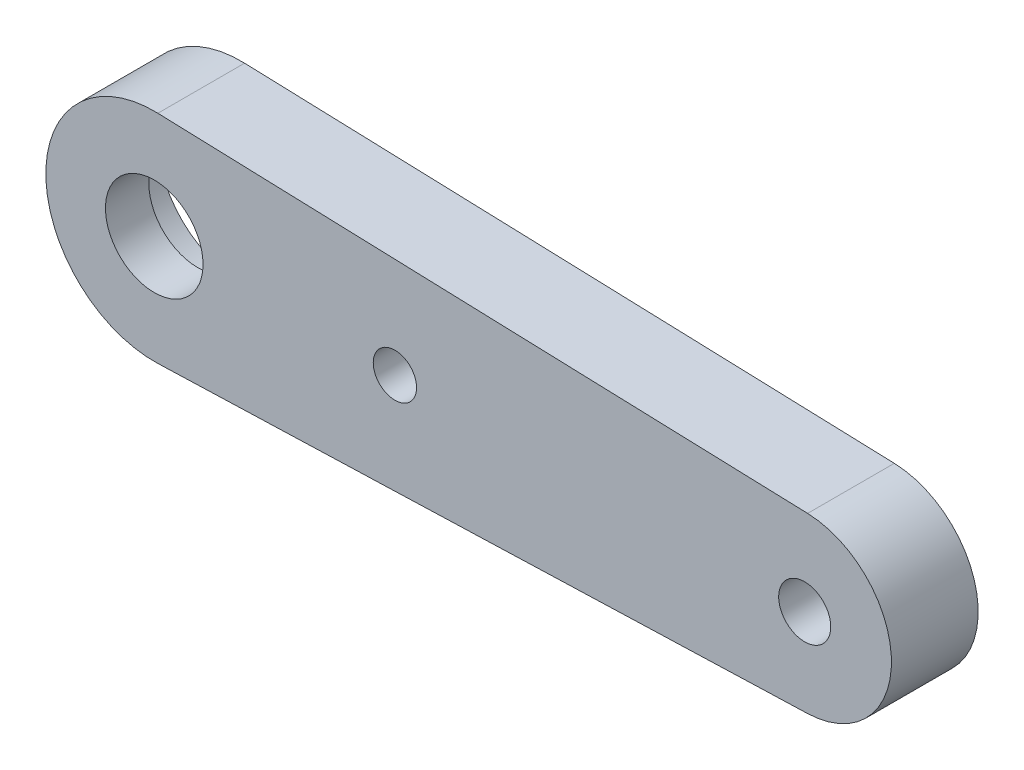
ISO-10303-21;
HEADER;
FILE_DESCRIPTION(('STEP AP214'),'2;1');
FILE_NAME('part.step','',(''),(''),'','','');
FILE_SCHEMA(('AUTOMOTIVE_DESIGN { 1 0 10303 214 1 1 1 1 }'));
ENDSEC;
DATA;
#1=APPLICATION_CONTEXT('core data for automotive mechanical design processes');
#2=APPLICATION_PROTOCOL_DEFINITION('international standard','automotive_design',2000,#1);
#3=PRODUCT_CONTEXT('',#1,'mechanical');
#4=PRODUCT('Part','Part','',(#3));
#5=PRODUCT_RELATED_PRODUCT_CATEGORY('part','',(#4));
#6=PRODUCT_DEFINITION_FORMATION('','',#4);
#7=PRODUCT_DEFINITION_CONTEXT('part definition',#1,'design');
#8=PRODUCT_DEFINITION('design','',#6,#7);
#9=PRODUCT_DEFINITION_SHAPE('','',#8);
#10=(LENGTH_UNIT() NAMED_UNIT(*) SI_UNIT(.MILLI.,.METRE.));
#11=(NAMED_UNIT(*) PLANE_ANGLE_UNIT() SI_UNIT($,.RADIAN.));
#12=(NAMED_UNIT(*) SI_UNIT($,.STERADIAN.) SOLID_ANGLE_UNIT());
#13=UNCERTAINTY_MEASURE_WITH_UNIT(LENGTH_MEASURE(1.E-05),#10,'distance_accuracy_value','');
#14=(GEOMETRIC_REPRESENTATION_CONTEXT(3) GLOBAL_UNCERTAINTY_ASSIGNED_CONTEXT((#13)) GLOBAL_UNIT_ASSIGNED_CONTEXT((#10,
#11,#12)) REPRESENTATION_CONTEXT('',''));
#15=CARTESIAN_POINT('',(0.,0.,0.));
#16=DIRECTION('',(0.,0.,1.));
#17=DIRECTION('',(1.,0.,0.));
#18=AXIS2_PLACEMENT_3D('',#15,#16,#17);
#19=CARTESIAN_POINT('',(0.166666666666667,-4.99722145018832,4.));
#20=DIRECTION('',(-0.0333333333333334,0.999444290037663,0.));
#21=DIRECTION('',(-0.999444290037663,-0.0333333333333334,0.));
#22=AXIS2_PLACEMENT_3D('',#19,#20,#21);
#23=PLANE('',#22);
#24=DIRECTION('',(0.999444290037663,0.0333333333333334,0.));
#25=VECTOR('',#24,1.);
#26=CARTESIAN_POINT('',(0.166666666666667,-4.99722145018832,0.));
#27=LINE('',#26,#25);
#28=CARTESIAN_POINT('',(0.166666666666667,-4.99722145018832,0.));
#29=VERTEX_POINT('',#28);
#30=CARTESIAN_POINT('',(30.1333333333333,-3.99777716015066,0.));
#31=VERTEX_POINT('',#30);
#32=EDGE_CURVE('E184',#29,#31,#27,.T.);
#33=ORIENTED_EDGE('',*,*,#32,.T.);
#34=DIRECTION('',(0.,0.,-1.));
#35=VECTOR('',#34,1.);
#36=CARTESIAN_POINT('',(30.1333333333333,-3.99777716015066,4.));
#37=LINE('',#36,#35);
#38=CARTESIAN_POINT('',(30.1333333333333,-3.99777716015066,4.));
#39=VERTEX_POINT('',#38);
#40=EDGE_CURVE('E11',#39,#31,#37,.T.);
#41=ORIENTED_EDGE('',*,*,#40,.F.);
#42=DIRECTION('',(0.999444290037663,0.0333333333333334,0.));
#43=VECTOR('',#42,1.);
#44=CARTESIAN_POINT('',(0.166666666666667,-4.99722145018832,4.));
#45=LINE('',#44,#43);
#46=CARTESIAN_POINT('',(0.166666666666667,-4.99722145018832,4.));
#47=VERTEX_POINT('',#46);
#48=EDGE_CURVE('E185',#47,#39,#45,.T.);
#49=ORIENTED_EDGE('',*,*,#48,.F.);
#50=DIRECTION('',(0.,0.,-1.));
#51=VECTOR('',#50,1.);
#52=CARTESIAN_POINT('',(0.166666666666667,-4.99722145018832,4.));
#53=LINE('',#52,#51);
#54=EDGE_CURVE('E196',#47,#29,#53,.T.);
#55=ORIENTED_EDGE('',*,*,#54,.T.);
#56=EDGE_LOOP('',(#33,#41,#49,#55));
#57=FACE_BOUND('',#56,.T.);
#58=ADVANCED_FACE('F39',(#57),#23,.F.);
#59=CARTESIAN_POINT('',(30.,0.,4.));
#60=DIRECTION('',(0.,0.,-1.));
#61=DIRECTION('',(-1.,0.,0.));
#62=AXIS2_PLACEMENT_3D('',#59,#60,#61);
#63=CYLINDRICAL_SURFACE('',#62,4.00000000000001);
#64=CARTESIAN_POINT('',(30.,0.,0.));
#65=DIRECTION('',(0.,0.,1.));
#66=DIRECTION('',(1.,0.,0.));
#67=AXIS2_PLACEMENT_3D('',#64,#65,#66);
#68=CIRCLE('',#67,4.00000000000001);
#69=CARTESIAN_POINT('',(30.1333333333333,3.99777716015066,0.));
#70=VERTEX_POINT('',#69);
#71=EDGE_CURVE('E199',#31,#70,#68,.T.);
#72=ORIENTED_EDGE('',*,*,#71,.T.);
#73=DIRECTION('',(0.,0.,-1.));
#74=VECTOR('',#73,1.);
#75=CARTESIAN_POINT('',(30.1333333333333,3.99777716015066,4.));
#76=LINE('',#75,#74);
#77=CARTESIAN_POINT('',(30.1333333333333,3.99777716015066,4.));
#78=VERTEX_POINT('',#77);
#79=EDGE_CURVE('E47',#78,#70,#76,.T.);
#80=ORIENTED_EDGE('',*,*,#79,.F.);
#81=CARTESIAN_POINT('',(30.,0.,4.));
#82=DIRECTION('',(0.,0.,1.));
#83=DIRECTION('',(1.,0.,0.));
#84=AXIS2_PLACEMENT_3D('',#81,#82,#83);
#85=CIRCLE('',#84,4.00000000000001);
#86=EDGE_CURVE('E91',#39,#78,#85,.T.);
#87=ORIENTED_EDGE('',*,*,#86,.F.);
#88=ORIENTED_EDGE('',*,*,#40,.T.);
#89=EDGE_LOOP('',(#72,#80,#87,#88));
#90=FACE_BOUND('',#89,.T.);
#91=ADVANCED_FACE('F214',(#90),#63,.T.);
#92=CARTESIAN_POINT('',(0.166666666666667,4.99722145018832,4.));
#93=DIRECTION('',(0.0333333333333333,0.999444290037663,0.));
#94=DIRECTION('',(-0.999444290037663,0.0333333333333333,0.));
#95=AXIS2_PLACEMENT_3D('',#92,#93,#94);
#96=PLANE('',#95);
#97=DIRECTION('',(0.999444290037663,-0.0333333333333333,0.));
#98=VECTOR('',#97,1.);
#99=CARTESIAN_POINT('',(0.166666666666667,4.99722145018832,0.));
#100=LINE('',#99,#98);
#101=CARTESIAN_POINT('',(0.166666666666665,4.99722145018832,0.));
#102=VERTEX_POINT('',#101);
#103=EDGE_CURVE('E202',#102,#70,#100,.T.);
#104=ORIENTED_EDGE('',*,*,#103,.F.);
#105=DIRECTION('',(0.,0.,-1.));
#106=VECTOR('',#105,1.);
#107=CARTESIAN_POINT('',(0.166666666666665,4.99722145018832,4.));
#108=LINE('',#107,#106);
#109=CARTESIAN_POINT('',(0.166666666666665,4.99722145018832,4.));
#110=VERTEX_POINT('',#109);
#111=EDGE_CURVE('E209',#110,#102,#108,.T.);
#112=ORIENTED_EDGE('',*,*,#111,.F.);
#113=DIRECTION('',(0.999444290037663,-0.0333333333333333,0.));
#114=VECTOR('',#113,1.);
#115=CARTESIAN_POINT('',(0.166666666666667,4.99722145018832,4.));
#116=LINE('',#115,#114);
#117=EDGE_CURVE('E189',#110,#78,#116,.T.);
#118=ORIENTED_EDGE('',*,*,#117,.T.);
#119=ORIENTED_EDGE('',*,*,#79,.T.);
#120=EDGE_LOOP('',(#104,#112,#118,#119));
#121=FACE_BOUND('',#120,.T.);
#122=ADVANCED_FACE('F213',(#121),#96,.T.);
#123=CARTESIAN_POINT('',(0.,0.,4.));
#124=DIRECTION('',(0.,0.,-1.));
#125=DIRECTION('',(-1.,0.,0.));
#126=AXIS2_PLACEMENT_3D('',#123,#124,#125);
#127=CYLINDRICAL_SURFACE('',#126,5.);
#128=CARTESIAN_POINT('',(0.,0.,0.));
#129=DIRECTION('',(0.,0.,1.));
#130=DIRECTION('',(1.,0.,0.));
#131=AXIS2_PLACEMENT_3D('',#128,#129,#130);
#132=CIRCLE('',#131,5.);
#133=EDGE_CURVE('E84',#102,#29,#132,.T.);
#134=ORIENTED_EDGE('',*,*,#133,.T.);
#135=ORIENTED_EDGE('',*,*,#54,.F.);
#136=CARTESIAN_POINT('',(0.,0.,4.));
#137=DIRECTION('',(0.,0.,1.));
#138=DIRECTION('',(1.,0.,0.));
#139=AXIS2_PLACEMENT_3D('',#136,#137,#138);
#140=CIRCLE('',#139,5.);
#141=EDGE_CURVE('E63',#110,#47,#140,.T.);
#142=ORIENTED_EDGE('',*,*,#141,.F.);
#143=ORIENTED_EDGE('',*,*,#111,.T.);
#144=EDGE_LOOP('',(#134,#135,#142,#143));
#145=FACE_BOUND('',#144,.T.);
#146=ADVANCED_FACE('F222',(#145),#127,.T.);
#147=CARTESIAN_POINT('',(30.,0.,4.));
#148=DIRECTION('',(0.,0.,-1.));
#149=DIRECTION('',(-1.,0.,0.));
#150=AXIS2_PLACEMENT_3D('',#147,#148,#149);
#151=CYLINDRICAL_SURFACE('',#150,1.2);
#152=CARTESIAN_POINT('',(30.,0.,4.));
#153=DIRECTION('',(0.,0.,1.));
#154=DIRECTION('',(1.,0.,0.));
#155=AXIS2_PLACEMENT_3D('',#152,#153,#154);
#156=CIRCLE('',#155,1.2);
#157=CARTESIAN_POINT('',(31.2,0.,4.));
#158=VERTEX_POINT('',#157);
#159=EDGE_CURVE('E193',#158,#158,#156,.T.);
#160=ORIENTED_EDGE('',*,*,#159,.T.);
#161=EDGE_LOOP('',(#160));
#162=FACE_BOUND('',#161,.T.);
#163=CARTESIAN_POINT('',(30.,0.,0.));
#164=DIRECTION('',(0.,0.,1.));
#165=DIRECTION('',(1.,0.,0.));
#166=AXIS2_PLACEMENT_3D('',#163,#164,#165);
#167=CIRCLE('',#166,1.2);
#168=CARTESIAN_POINT('',(31.2,0.,0.));
#169=VERTEX_POINT('',#168);
#170=EDGE_CURVE('E187',#169,#169,#167,.T.);
#171=ORIENTED_EDGE('',*,*,#170,.F.);
#172=EDGE_LOOP('',(#171));
#173=FACE_BOUND('',#172,.T.);
#174=ADVANCED_FACE('F226',(#162,#173),#151,.F.);
#175=CARTESIAN_POINT('',(0.,0.,4.));
#176=DIRECTION('',(0.,0.,1.));
#177=DIRECTION('',(1.,0.,0.));
#178=AXIS2_PLACEMENT_3D('',#175,#176,#177);
#179=PLANE('',#178);
#180=CARTESIAN_POINT('',(-3.0739299994309E-12,1.05644659686988E-12,4.));
#181=DIRECTION('',(0.,0.,1.));
#182=DIRECTION('',(1.,0.,0.));
#183=AXIS2_PLACEMENT_3D('',#180,#181,#182);
#184=CIRCLE('',#183,2.25000000000266);
#185=CARTESIAN_POINT('',(2.24999999999959,1.05644659686988E-12,4.));
#186=VERTEX_POINT('',#185);
#187=EDGE_CURVE('E450',#186,#186,#184,.T.);
#188=ORIENTED_EDGE('',*,*,#187,.F.);
#189=EDGE_LOOP('',(#188));
#190=FACE_BOUND('',#189,.T.);
#191=CARTESIAN_POINT('',(11.1,0.,4.));
#192=DIRECTION('',(0.,0.,1.));
#193=DIRECTION('',(1.,0.,0.));
#194=AXIS2_PLACEMENT_3D('',#191,#192,#193);
#195=CIRCLE('',#194,1.);
#196=CARTESIAN_POINT('',(12.1,0.,4.));
#197=VERTEX_POINT('',#196);
#198=EDGE_CURVE('E156',#197,#197,#195,.T.);
#199=ORIENTED_EDGE('',*,*,#198,.F.);
#200=EDGE_LOOP('',(#199));
#201=FACE_BOUND('',#200,.T.);
#202=ORIENTED_EDGE('',*,*,#48,.T.);
#203=ORIENTED_EDGE('',*,*,#86,.T.);
#204=ORIENTED_EDGE('',*,*,#117,.F.);
#205=ORIENTED_EDGE('',*,*,#141,.T.);
#206=EDGE_LOOP('',(#202,#203,#204,#205));
#207=FACE_BOUND('',#206,.T.);
#208=ORIENTED_EDGE('',*,*,#159,.F.);
#209=EDGE_LOOP('',(#208));
#210=FACE_BOUND('',#209,.T.);
#211=ADVANCED_FACE('F223',(#190,#201,#207,#210),#179,.T.);
#212=CARTESIAN_POINT('',(0.,0.,0.));
#213=DIRECTION('',(0.,0.,1.));
#214=DIRECTION('',(1.,0.,0.));
#215=AXIS2_PLACEMENT_3D('',#212,#213,#214);
#216=PLANE('',#215);
#217=CARTESIAN_POINT('',(0.,0.,0.));
#218=DIRECTION('',(0.,0.,1.));
#219=DIRECTION('',(1.,0.,0.));
#220=AXIS2_PLACEMENT_3D('',#217,#218,#219);
#221=CIRCLE('',#220,3.85);
#222=CARTESIAN_POINT('',(0.363207547169811,-3.83282927844157,0.));
#223=VERTEX_POINT('',#222);
#224=CARTESIAN_POINT('',(0.363207547169811,3.83282927844157,0.));
#225=VERTEX_POINT('',#224);
#226=EDGE_CURVE('E178',#223,#225,#221,.F.);
#227=ORIENTED_EDGE('',*,*,#226,.F.);
#228=DIRECTION('',(-0.995540072322485,-0.0943396226415095,0.));
#229=VECTOR('',#228,1.);
#230=CARTESIAN_POINT('',(0.363207547169812,-3.83282927844157,0.));
#231=LINE('',#230,#229);
#232=CARTESIAN_POINT('',(16.1216981132075,-2.33951916995784,0.));
#233=VERTEX_POINT('',#232);
#234=EDGE_CURVE('E134',#233,#223,#231,.T.);
#235=ORIENTED_EDGE('',*,*,#234,.F.);
#236=CARTESIAN_POINT('',(15.9,0.,0.));
#237=DIRECTION('',(0.,0.,1.));
#238=DIRECTION('',(1.,0.,0.));
#239=AXIS2_PLACEMENT_3D('',#236,#237,#238);
#240=CIRCLE('',#239,2.35);
#241=CARTESIAN_POINT('',(16.1216981132075,2.33951916995784,0.));
#242=VERTEX_POINT('',#241);
#243=EDGE_CURVE('E180',#242,#233,#240,.F.);
#244=ORIENTED_EDGE('',*,*,#243,.F.);
#245=DIRECTION('',(-0.995540072322485,0.0943396226415095,0.));
#246=VECTOR('',#245,1.);
#247=CARTESIAN_POINT('',(0.363207547169812,3.83282927844157,0.));
#248=LINE('',#247,#246);
#249=EDGE_CURVE('E137',#242,#225,#248,.T.);
#250=ORIENTED_EDGE('',*,*,#249,.T.);
#251=EDGE_LOOP('',(#227,#235,#244,#250));
#252=FACE_BOUND('',#251,.T.);
#253=ORIENTED_EDGE('',*,*,#32,.F.);
#254=ORIENTED_EDGE('',*,*,#133,.F.);
#255=ORIENTED_EDGE('',*,*,#103,.T.);
#256=ORIENTED_EDGE('',*,*,#71,.F.);
#257=EDGE_LOOP('',(#253,#254,#255,#256));
#258=FACE_BOUND('',#257,.T.);
#259=ORIENTED_EDGE('',*,*,#170,.T.);
#260=EDGE_LOOP('',(#259));
#261=FACE_BOUND('',#260,.T.);
#262=ADVANCED_FACE('F218',(#252,#258,#261),#216,.F.);
#263=CARTESIAN_POINT('',(0.363207547169812,-3.83282927844157,-23.4029912618024));
#264=DIRECTION('',(0.0943396226415095,-0.995540072322485,0.));
#265=DIRECTION('',(0.995540072322485,0.0943396226415095,0.));
#266=AXIS2_PLACEMENT_3D('',#263,#264,#265);
#267=PLANE('',#266);
#268=ORIENTED_EDGE('',*,*,#234,.T.);
#269=DIRECTION('',(0.,0.,1.));
#270=VECTOR('',#269,1.);
#271=CARTESIAN_POINT('',(0.363207547169811,-3.83282927844157,-23.4029912618024));
#272=LINE('',#271,#270);
#273=CARTESIAN_POINT('',(0.363207547169812,-3.83282927844157,2.));
#274=VERTEX_POINT('',#273);
#275=EDGE_CURVE('E126',#223,#274,#272,.T.);
#276=ORIENTED_EDGE('',*,*,#275,.T.);
#277=DIRECTION('',(-0.995540072322485,-0.0943396226415095,0.));
#278=VECTOR('',#277,1.);
#279=CARTESIAN_POINT('',(0.363207547169812,-3.83282927844157,2.));
#280=LINE('',#279,#278);
#281=CARTESIAN_POINT('',(6.,-3.29867411212271,2.));
#282=VERTEX_POINT('',#281);
#283=EDGE_CURVE('E130',#282,#274,#280,.T.);
#284=ORIENTED_EDGE('',*,*,#283,.F.);
#285=DIRECTION('',(0.,0.,-1.));
#286=VECTOR('',#285,1.);
#287=CARTESIAN_POINT('',(6.,-3.29867411212271,2.));
#288=LINE('',#287,#286);
#289=CARTESIAN_POINT('',(6.,-3.29867411212271,1.5));
#290=VERTEX_POINT('',#289);
#291=EDGE_CURVE('E164',#282,#290,#288,.T.);
#292=ORIENTED_EDGE('',*,*,#291,.T.);
#293=DIRECTION('',(0.995540072322485,0.0943396226415095,0.));
#294=VECTOR('',#293,1.);
#295=CARTESIAN_POINT('',(0.363207547169812,-3.83282927844157,1.5));
#296=LINE('',#295,#294);
#297=CARTESIAN_POINT('',(16.1216981132075,-2.33951916995784,1.5));
#298=VERTEX_POINT('',#297);
#299=EDGE_CURVE('E171',#290,#298,#296,.T.);
#300=ORIENTED_EDGE('',*,*,#299,.T.);
#301=DIRECTION('',(0.,0.,1.));
#302=VECTOR('',#301,1.);
#303=CARTESIAN_POINT('',(16.1216981132075,-2.33951916995784,-23.4029912618024));
#304=LINE('',#303,#302);
#305=EDGE_CURVE('E138',#233,#298,#304,.T.);
#306=ORIENTED_EDGE('',*,*,#305,.F.);
#307=EDGE_LOOP('',(#268,#276,#284,#292,#300,#306));
#308=FACE_BOUND('',#307,.T.);
#309=ADVANCED_FACE('F128',(#308),#267,.F.);
#310=CARTESIAN_POINT('',(0.,0.,-23.4029912618024));
#311=DIRECTION('',(0.,0.,1.));
#312=DIRECTION('',(1.,0.,0.));
#313=AXIS2_PLACEMENT_3D('',#310,#311,#312);
#314=CYLINDRICAL_SURFACE('',#313,3.85);
#315=ORIENTED_EDGE('',*,*,#226,.T.);
#316=DIRECTION('',(0.,0.,1.));
#317=VECTOR('',#316,1.);
#318=CARTESIAN_POINT('',(0.363207547169811,3.83282927844157,-23.4029912618024));
#319=LINE('',#318,#317);
#320=CARTESIAN_POINT('',(0.363207547169811,3.83282927844157,2.));
#321=VERTEX_POINT('',#320);
#322=EDGE_CURVE('E144',#225,#321,#319,.T.);
#323=ORIENTED_EDGE('',*,*,#322,.T.);
#324=CARTESIAN_POINT('',(0.,0.,2.));
#325=DIRECTION('',(0.,0.,-1.));
#326=DIRECTION('',(-1.,0.,0.));
#327=AXIS2_PLACEMENT_3D('',#324,#325,#326);
#328=CIRCLE('',#327,3.85);
#329=EDGE_CURVE('E141',#274,#321,#328,.T.);
#330=ORIENTED_EDGE('',*,*,#329,.F.);
#331=ORIENTED_EDGE('',*,*,#275,.F.);
#332=EDGE_LOOP('',(#315,#323,#330,#331));
#333=FACE_BOUND('',#332,.T.);
#334=ADVANCED_FACE('F142',(#333),#314,.F.);
#335=CARTESIAN_POINT('',(0.363207547169812,3.83282927844157,-23.4029912618024));
#336=DIRECTION('',(-0.0943396226415095,-0.995540072322485,0.));
#337=DIRECTION('',(0.995540072322485,-0.0943396226415095,0.));
#338=AXIS2_PLACEMENT_3D('',#335,#336,#337);
#339=PLANE('',#338);
#340=DIRECTION('',(0.,0.,1.));
#341=VECTOR('',#340,1.);
#342=CARTESIAN_POINT('',(16.1216981132075,2.33951916995784,-23.4029912618024));
#343=LINE('',#342,#341);
#344=CARTESIAN_POINT('',(16.1216981132075,2.33951916995784,1.5));
#345=VERTEX_POINT('',#344);
#346=EDGE_CURVE('E54',#242,#345,#343,.T.);
#347=ORIENTED_EDGE('',*,*,#346,.T.);
#348=DIRECTION('',(0.995540072322485,-0.0943396226415095,0.));
#349=VECTOR('',#348,1.);
#350=CARTESIAN_POINT('',(0.363207547169812,3.83282927844157,1.5));
#351=LINE('',#350,#349);
#352=CARTESIAN_POINT('',(6.,3.2986741121227,1.5));
#353=VERTEX_POINT('',#352);
#354=EDGE_CURVE('E167',#353,#345,#351,.T.);
#355=ORIENTED_EDGE('',*,*,#354,.F.);
#356=DIRECTION('',(0.,0.,-1.));
#357=VECTOR('',#356,1.);
#358=CARTESIAN_POINT('',(6.,3.2986741121227,2.));
#359=LINE('',#358,#357);
#360=CARTESIAN_POINT('',(6.,3.2986741121227,2.));
#361=VERTEX_POINT('',#360);
#362=EDGE_CURVE('E162',#361,#353,#359,.T.);
#363=ORIENTED_EDGE('',*,*,#362,.F.);
#364=DIRECTION('',(0.995540072322485,-0.0943396226415095,0.));
#365=VECTOR('',#364,1.);
#366=CARTESIAN_POINT('',(0.363207547169812,3.83282927844157,2.));
#367=LINE('',#366,#365);
#368=EDGE_CURVE('E148',#321,#361,#367,.T.);
#369=ORIENTED_EDGE('',*,*,#368,.F.);
#370=ORIENTED_EDGE('',*,*,#322,.F.);
#371=ORIENTED_EDGE('',*,*,#249,.F.);
#372=EDGE_LOOP('',(#347,#355,#363,#369,#370,#371));
#373=FACE_BOUND('',#372,.T.);
#374=ADVANCED_FACE('F314',(#373),#339,.T.);
#375=CARTESIAN_POINT('',(15.9,0.,-23.4029912618024));
#376=DIRECTION('',(0.,0.,1.));
#377=DIRECTION('',(1.,0.,0.));
#378=AXIS2_PLACEMENT_3D('',#375,#376,#377);
#379=CYLINDRICAL_SURFACE('',#378,2.35);
#380=ORIENTED_EDGE('',*,*,#243,.T.);
#381=ORIENTED_EDGE('',*,*,#305,.T.);
#382=CARTESIAN_POINT('',(15.9,0.,1.5));
#383=DIRECTION('',(0.,0.,1.));
#384=DIRECTION('',(1.,0.,0.));
#385=AXIS2_PLACEMENT_3D('',#382,#383,#384);
#386=CIRCLE('',#385,2.35);
#387=EDGE_CURVE('E169',#298,#345,#386,.T.);
#388=ORIENTED_EDGE('',*,*,#387,.T.);
#389=ORIENTED_EDGE('',*,*,#346,.F.);
#390=EDGE_LOOP('',(#380,#381,#388,#389));
#391=FACE_BOUND('',#390,.T.);
#392=ADVANCED_FACE('F310',(#391),#379,.F.);
#393=CARTESIAN_POINT('',(0.,0.,1.5));
#394=DIRECTION('',(0.,0.,1.));
#395=DIRECTION('',(1.,0.,0.));
#396=AXIS2_PLACEMENT_3D('',#393,#394,#395);
#397=PLANE('',#396);
#398=CARTESIAN_POINT('',(11.1,0.,1.5));
#399=DIRECTION('',(0.,0.,-1.));
#400=DIRECTION('',(-1.,0.,0.));
#401=AXIS2_PLACEMENT_3D('',#398,#399,#400);
#402=CIRCLE('',#401,1.);
#403=CARTESIAN_POINT('',(10.1,0.,1.5));
#404=VERTEX_POINT('',#403);
#405=EDGE_CURVE('E448',#404,#404,#402,.T.);
#406=ORIENTED_EDGE('',*,*,#405,.F.);
#407=EDGE_LOOP('',(#406));
#408=FACE_BOUND('',#407,.T.);
#409=ORIENTED_EDGE('',*,*,#299,.F.);
#410=DIRECTION('',(0.,-1.,0.));
#411=VECTOR('',#410,1.);
#412=CARTESIAN_POINT('',(6.,0.,1.5));
#413=LINE('',#412,#411);
#414=EDGE_CURVE('E153',#353,#290,#413,.T.);
#415=ORIENTED_EDGE('',*,*,#414,.F.);
#416=ORIENTED_EDGE('',*,*,#354,.T.);
#417=ORIENTED_EDGE('',*,*,#387,.F.);
#418=EDGE_LOOP('',(#409,#415,#416,#417));
#419=FACE_BOUND('',#418,.T.);
#420=ADVANCED_FACE('F306',(#408,#419),#397,.F.);
#421=CARTESIAN_POINT('',(6.,0.,2.));
#422=DIRECTION('',(1.,0.,0.));
#423=DIRECTION('',(0.,1.,0.));
#424=AXIS2_PLACEMENT_3D('',#421,#422,#423);
#425=PLANE('',#424);
#426=ORIENTED_EDGE('',*,*,#414,.T.);
#427=ORIENTED_EDGE('',*,*,#291,.F.);
#428=DIRECTION('',(0.,-1.,0.));
#429=VECTOR('',#428,1.);
#430=CARTESIAN_POINT('',(6.,0.,2.));
#431=LINE('',#430,#429);
#432=EDGE_CURVE('E152',#361,#282,#431,.T.);
#433=ORIENTED_EDGE('',*,*,#432,.F.);
#434=ORIENTED_EDGE('',*,*,#362,.T.);
#435=EDGE_LOOP('',(#426,#427,#433,#434));
#436=FACE_BOUND('',#435,.T.);
#437=ADVANCED_FACE('F281',(#436),#425,.F.);
#438=CARTESIAN_POINT('',(0.,0.,2.));
#439=DIRECTION('',(0.,0.,-1.));
#440=DIRECTION('',(-1.,0.,0.));
#441=AXIS2_PLACEMENT_3D('',#438,#439,#440);
#442=PLANE('',#441);
#443=CARTESIAN_POINT('',(-3.0739299994309E-12,1.05644659686988E-12,2.));
#444=DIRECTION('',(0.,0.,-1.));
#445=DIRECTION('',(-1.,0.,0.));
#446=AXIS2_PLACEMENT_3D('',#443,#444,#445);
#447=CIRCLE('',#446,2.25000000000266);
#448=CARTESIAN_POINT('',(-2.25000000000573,1.05644659686988E-12,2.));
#449=VERTEX_POINT('',#448);
#450=EDGE_CURVE('E42',#449,#449,#447,.T.);
#451=ORIENTED_EDGE('',*,*,#450,.F.);
#452=EDGE_LOOP('',(#451));
#453=FACE_BOUND('',#452,.T.);
#454=ORIENTED_EDGE('',*,*,#283,.T.);
#455=ORIENTED_EDGE('',*,*,#329,.T.);
#456=ORIENTED_EDGE('',*,*,#368,.T.);
#457=ORIENTED_EDGE('',*,*,#432,.T.);
#458=EDGE_LOOP('',(#454,#455,#456,#457));
#459=FACE_BOUND('',#458,.T.);
#460=ADVANCED_FACE('F150',(#453,#459),#442,.T.);
#461=CARTESIAN_POINT('',(11.1,0.,7.5));
#462=DIRECTION('',(0.,0.,-1.));
#463=DIRECTION('',(-1.,0.,0.));
#464=AXIS2_PLACEMENT_3D('',#461,#462,#463);
#465=CYLINDRICAL_SURFACE('',#464,1.);
#466=ORIENTED_EDGE('',*,*,#198,.T.);
#467=EDGE_LOOP('',(#466));
#468=FACE_BOUND('',#467,.T.);
#469=ORIENTED_EDGE('',*,*,#405,.T.);
#470=EDGE_LOOP('',(#469));
#471=FACE_BOUND('',#470,.T.);
#472=ADVANCED_FACE('F272',(#468,#471),#465,.F.);
#473=CARTESIAN_POINT('',(-3.0739299994309E-12,1.05644659686988E-12,-6.));
#474=DIRECTION('',(0.,0.,1.));
#475=DIRECTION('',(1.,0.,0.));
#476=AXIS2_PLACEMENT_3D('',#473,#474,#475);
#477=CYLINDRICAL_SURFACE('',#476,2.25000000000266);
#478=ORIENTED_EDGE('',*,*,#450,.T.);
#479=EDGE_LOOP('',(#478));
#480=FACE_BOUND('',#479,.T.);
#481=ORIENTED_EDGE('',*,*,#187,.T.);
#482=EDGE_LOOP('',(#481));
#483=FACE_BOUND('',#482,.T.);
#484=ADVANCED_FACE('F289',(#480,#483),#477,.F.);
#485=CLOSED_SHELL('',(#58,#91,#122,#146,#174,#211,#262,#309,#334,#374,#392,#420,#437,#460,#472,#484));
#486=MANIFOLD_SOLID_BREP('B2',#485);
#487=ADVANCED_BREP_SHAPE_REPRESENTATION('',(#18,#486),#14);
#488=SHAPE_DEFINITION_REPRESENTATION(#9,#487);
ENDSEC;
END-ISO-10303-21;
